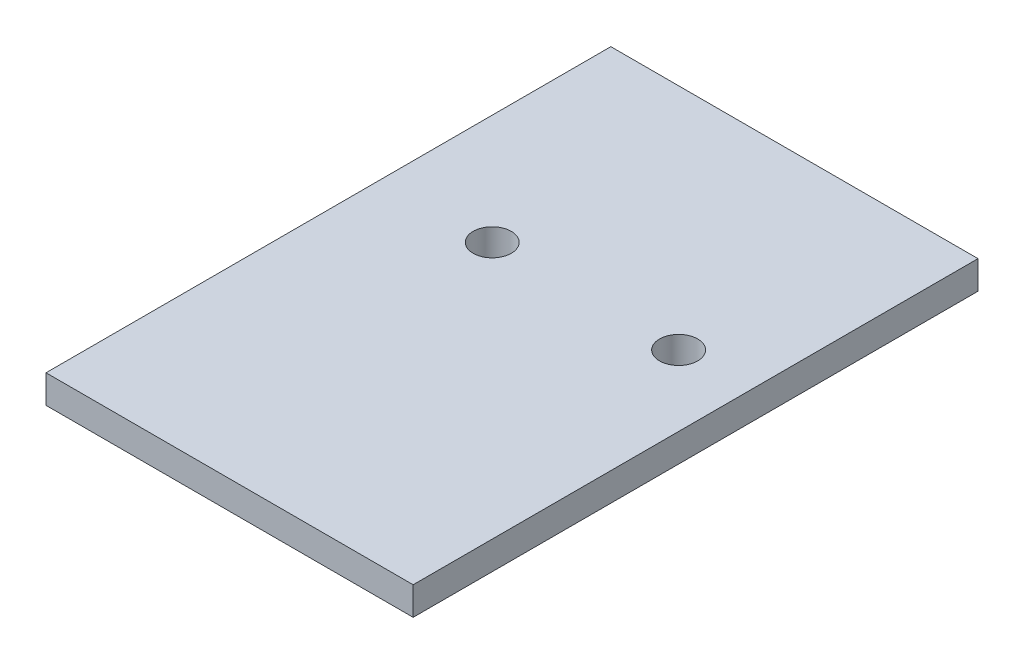
ISO-10303-21;
HEADER;
FILE_DESCRIPTION(('STEP AP214'),'2;1');
FILE_NAME('part.step','',(''),(''),'','','');
FILE_SCHEMA(('AUTOMOTIVE_DESIGN { 1 0 10303 214 1 1 1 1 }'));
ENDSEC;
DATA;
#1=APPLICATION_CONTEXT('core data for automotive mechanical design processes');
#2=APPLICATION_PROTOCOL_DEFINITION('international standard','automotive_design',2000,#1);
#3=PRODUCT_CONTEXT('',#1,'mechanical');
#4=PRODUCT('Part','Part','',(#3));
#5=PRODUCT_RELATED_PRODUCT_CATEGORY('part','',(#4));
#6=PRODUCT_DEFINITION_FORMATION('','',#4);
#7=PRODUCT_DEFINITION_CONTEXT('part definition',#1,'design');
#8=PRODUCT_DEFINITION('design','',#6,#7);
#9=PRODUCT_DEFINITION_SHAPE('','',#8);
#10=(LENGTH_UNIT() NAMED_UNIT(*) SI_UNIT(.MILLI.,.METRE.));
#11=(NAMED_UNIT(*) PLANE_ANGLE_UNIT() SI_UNIT($,.RADIAN.));
#12=(NAMED_UNIT(*) SI_UNIT($,.STERADIAN.) SOLID_ANGLE_UNIT());
#13=UNCERTAINTY_MEASURE_WITH_UNIT(LENGTH_MEASURE(1.E-05),#10,'distance_accuracy_value','');
#14=(GEOMETRIC_REPRESENTATION_CONTEXT(3) GLOBAL_UNCERTAINTY_ASSIGNED_CONTEXT((#13)) GLOBAL_UNIT_ASSIGNED_CONTEXT((#10,
#11,#12)) REPRESENTATION_CONTEXT('',''));
#15=CARTESIAN_POINT('',(0.,0.,0.));
#16=DIRECTION('',(0.,0.,1.));
#17=DIRECTION('',(1.,0.,0.));
#18=AXIS2_PLACEMENT_3D('',#15,#16,#17);
#19=CARTESIAN_POINT('',(0.,2.54,0.));
#20=DIRECTION('',(0.,-1.,0.));
#21=DIRECTION('',(0.,0.,-1.));
#22=AXIS2_PLACEMENT_3D('',#19,#20,#21);
#23=PLANE('',#22);
#24=DIRECTION('',(0.,0.,1.));
#25=VECTOR('',#24,1.);
#26=CARTESIAN_POINT('',(0.,2.54,0.));
#27=LINE('',#26,#25);
#28=CARTESIAN_POINT('',(0.,2.54,-50.8));
#29=VERTEX_POINT('',#28);
#30=CARTESIAN_POINT('',(0.,2.54,0.));
#31=VERTEX_POINT('',#30);
#32=EDGE_CURVE('E86',#29,#31,#27,.T.);
#33=ORIENTED_EDGE('',*,*,#32,.T.);
#34=DIRECTION('',(1.,0.,0.));
#35=VECTOR('',#34,1.);
#36=CARTESIAN_POINT('',(0.,2.54,0.));
#37=LINE('',#36,#35);
#38=CARTESIAN_POINT('',(33.02,2.54,0.));
#39=VERTEX_POINT('',#38);
#40=EDGE_CURVE('E81',#31,#39,#37,.T.);
#41=ORIENTED_EDGE('',*,*,#40,.T.);
#42=DIRECTION('',(0.,0.,-1.));
#43=VECTOR('',#42,1.);
#44=CARTESIAN_POINT('',(33.02,2.54,0.));
#45=LINE('',#44,#43);
#46=CARTESIAN_POINT('',(33.02,2.54,-50.8));
#47=VERTEX_POINT('',#46);
#48=EDGE_CURVE('E84',#39,#47,#45,.T.);
#49=ORIENTED_EDGE('',*,*,#48,.T.);
#50=DIRECTION('',(-1.,0.,0.));
#51=VECTOR('',#50,1.);
#52=CARTESIAN_POINT('',(0.,2.54,-50.8));
#53=LINE('',#52,#51);
#54=EDGE_CURVE('E51',#47,#29,#53,.T.);
#55=ORIENTED_EDGE('',*,*,#54,.T.);
#56=EDGE_LOOP('',(#33,#41,#49,#55));
#57=FACE_BOUND('',#56,.T.);
#58=CARTESIAN_POINT('',(9.906,2.54,-30.226));
#59=DIRECTION('',(0.,1.,0.));
#60=DIRECTION('',(0.,0.,1.));
#61=AXIS2_PLACEMENT_3D('',#58,#59,#60);
#62=CIRCLE('',#61,1.7145);
#63=CARTESIAN_POINT('',(9.906,2.54,-28.5115));
#64=VERTEX_POINT('',#63);
#65=EDGE_CURVE('E101',#64,#64,#62,.T.);
#66=ORIENTED_EDGE('',*,*,#65,.F.);
#67=EDGE_LOOP('',(#66));
#68=FACE_BOUND('',#67,.T.);
#69=CARTESIAN_POINT('',(26.67,2.54,-30.226));
#70=DIRECTION('',(0.,1.,0.));
#71=DIRECTION('',(0.,0.,1.));
#72=AXIS2_PLACEMENT_3D('',#69,#70,#71);
#73=CIRCLE('',#72,1.7145);
#74=CARTESIAN_POINT('',(26.67,2.54,-28.5115));
#75=VERTEX_POINT('',#74);
#76=EDGE_CURVE('E116',#75,#75,#73,.T.);
#77=ORIENTED_EDGE('',*,*,#76,.F.);
#78=EDGE_LOOP('',(#77));
#79=FACE_BOUND('',#78,.T.);
#80=ADVANCED_FACE('F34',(#57,#68,#79),#23,.F.);
#81=CARTESIAN_POINT('',(0.,0.,0.));
#82=DIRECTION('',(0.,-1.,0.));
#83=DIRECTION('',(0.,0.,-1.));
#84=AXIS2_PLACEMENT_3D('',#81,#82,#83);
#85=PLANE('',#84);
#86=CARTESIAN_POINT('',(9.906,0.,-30.226));
#87=DIRECTION('',(0.,1.,0.));
#88=DIRECTION('',(0.,0.,1.));
#89=AXIS2_PLACEMENT_3D('',#86,#87,#88);
#90=CIRCLE('',#89,1.7145);
#91=CARTESIAN_POINT('',(9.906,0.,-28.5115));
#92=VERTEX_POINT('',#91);
#93=EDGE_CURVE('E113',#92,#92,#90,.T.);
#94=ORIENTED_EDGE('',*,*,#93,.T.);
#95=EDGE_LOOP('',(#94));
#96=FACE_BOUND('',#95,.T.);
#97=DIRECTION('',(0.,0.,1.));
#98=VECTOR('',#97,1.);
#99=CARTESIAN_POINT('',(0.,0.,0.));
#100=LINE('',#99,#98);
#101=CARTESIAN_POINT('',(0.,0.,-50.8));
#102=VERTEX_POINT('',#101);
#103=CARTESIAN_POINT('',(0.,0.,0.));
#104=VERTEX_POINT('',#103);
#105=EDGE_CURVE('E98',#102,#104,#100,.T.);
#106=ORIENTED_EDGE('',*,*,#105,.F.);
#107=DIRECTION('',(-1.,0.,0.));
#108=VECTOR('',#107,1.);
#109=CARTESIAN_POINT('',(0.,0.,-50.8));
#110=LINE('',#109,#108);
#111=CARTESIAN_POINT('',(33.02,0.,-50.8));
#112=VERTEX_POINT('',#111);
#113=EDGE_CURVE('E74',#112,#102,#110,.T.);
#114=ORIENTED_EDGE('',*,*,#113,.F.);
#115=DIRECTION('',(0.,0.,-1.));
#116=VECTOR('',#115,1.);
#117=CARTESIAN_POINT('',(33.02,0.,0.));
#118=LINE('',#117,#116);
#119=CARTESIAN_POINT('',(33.02,0.,0.));
#120=VERTEX_POINT('',#119);
#121=EDGE_CURVE('E68',#120,#112,#118,.T.);
#122=ORIENTED_EDGE('',*,*,#121,.F.);
#123=DIRECTION('',(1.,0.,0.));
#124=VECTOR('',#123,1.);
#125=CARTESIAN_POINT('',(0.,0.,0.));
#126=LINE('',#125,#124);
#127=EDGE_CURVE('E90',#104,#120,#126,.T.);
#128=ORIENTED_EDGE('',*,*,#127,.F.);
#129=EDGE_LOOP('',(#106,#114,#122,#128));
#130=FACE_BOUND('',#129,.T.);
#131=CARTESIAN_POINT('',(26.67,0.,-30.226));
#132=DIRECTION('',(0.,1.,0.));
#133=DIRECTION('',(0.,0.,1.));
#134=AXIS2_PLACEMENT_3D('',#131,#132,#133);
#135=CIRCLE('',#134,1.7145);
#136=CARTESIAN_POINT('',(26.67,0.,-28.5115));
#137=VERTEX_POINT('',#136);
#138=EDGE_CURVE('E119',#137,#137,#135,.T.);
#139=ORIENTED_EDGE('',*,*,#138,.T.);
#140=EDGE_LOOP('',(#139));
#141=FACE_BOUND('',#140,.T.);
#142=ADVANCED_FACE('F109',(#96,#130,#141),#85,.T.);
#143=CARTESIAN_POINT('',(0.,2.54,0.));
#144=DIRECTION('',(1.,0.,0.));
#145=DIRECTION('',(0.,0.,-1.));
#146=AXIS2_PLACEMENT_3D('',#143,#144,#145);
#147=PLANE('',#146);
#148=ORIENTED_EDGE('',*,*,#105,.T.);
#149=DIRECTION('',(0.,-1.,0.));
#150=VECTOR('',#149,1.);
#151=CARTESIAN_POINT('',(0.,2.54,0.));
#152=LINE('',#151,#150);
#153=EDGE_CURVE('E11',#31,#104,#152,.T.);
#154=ORIENTED_EDGE('',*,*,#153,.F.);
#155=ORIENTED_EDGE('',*,*,#32,.F.);
#156=DIRECTION('',(0.,-1.,0.));
#157=VECTOR('',#156,1.);
#158=CARTESIAN_POINT('',(0.,2.54,-50.8));
#159=LINE('',#158,#157);
#160=EDGE_CURVE('E94',#29,#102,#159,.T.);
#161=ORIENTED_EDGE('',*,*,#160,.T.);
#162=EDGE_LOOP('',(#148,#154,#155,#161));
#163=FACE_BOUND('',#162,.T.);
#164=ADVANCED_FACE('F36',(#163),#147,.F.);
#165=CARTESIAN_POINT('',(0.,2.54,0.));
#166=DIRECTION('',(0.,0.,-1.));
#167=DIRECTION('',(-1.,0.,0.));
#168=AXIS2_PLACEMENT_3D('',#165,#166,#167);
#169=PLANE('',#168);
#170=ORIENTED_EDGE('',*,*,#127,.T.);
#171=DIRECTION('',(0.,-1.,0.));
#172=VECTOR('',#171,1.);
#173=CARTESIAN_POINT('',(33.02,2.54,0.));
#174=LINE('',#173,#172);
#175=EDGE_CURVE('E43',#39,#120,#174,.T.);
#176=ORIENTED_EDGE('',*,*,#175,.F.);
#177=ORIENTED_EDGE('',*,*,#40,.F.);
#178=ORIENTED_EDGE('',*,*,#153,.T.);
#179=EDGE_LOOP('',(#170,#176,#177,#178));
#180=FACE_BOUND('',#179,.T.);
#181=ADVANCED_FACE('F89',(#180),#169,.F.);
#182=CARTESIAN_POINT('',(33.02,2.54,0.));
#183=DIRECTION('',(-1.,0.,0.));
#184=DIRECTION('',(0.,0.,1.));
#185=AXIS2_PLACEMENT_3D('',#182,#183,#184);
#186=PLANE('',#185);
#187=ORIENTED_EDGE('',*,*,#121,.T.);
#188=DIRECTION('',(0.,-1.,0.));
#189=VECTOR('',#188,1.);
#190=CARTESIAN_POINT('',(33.02,2.54,-50.8));
#191=LINE('',#190,#189);
#192=EDGE_CURVE('E91',#47,#112,#191,.T.);
#193=ORIENTED_EDGE('',*,*,#192,.F.);
#194=ORIENTED_EDGE('',*,*,#48,.F.);
#195=ORIENTED_EDGE('',*,*,#175,.T.);
#196=EDGE_LOOP('',(#187,#193,#194,#195));
#197=FACE_BOUND('',#196,.T.);
#198=ADVANCED_FACE('F92',(#197),#186,.F.);
#199=CARTESIAN_POINT('',(0.,2.54,-50.8));
#200=DIRECTION('',(0.,0.,1.));
#201=DIRECTION('',(1.,0.,0.));
#202=AXIS2_PLACEMENT_3D('',#199,#200,#201);
#203=PLANE('',#202);
#204=ORIENTED_EDGE('',*,*,#113,.T.);
#205=ORIENTED_EDGE('',*,*,#160,.F.);
#206=ORIENTED_EDGE('',*,*,#54,.F.);
#207=ORIENTED_EDGE('',*,*,#192,.T.);
#208=EDGE_LOOP('',(#204,#205,#206,#207));
#209=FACE_BOUND('',#208,.T.);
#210=ADVANCED_FACE('F106',(#209),#203,.F.);
#211=CARTESIAN_POINT('',(9.906,2.54,-30.226));
#212=DIRECTION('',(0.,-1.,0.));
#213=DIRECTION('',(0.,0.,-1.));
#214=AXIS2_PLACEMENT_3D('',#211,#212,#213);
#215=CYLINDRICAL_SURFACE('',#214,1.7145);
#216=ORIENTED_EDGE('',*,*,#65,.T.);
#217=EDGE_LOOP('',(#216));
#218=FACE_BOUND('',#217,.T.);
#219=ORIENTED_EDGE('',*,*,#93,.F.);
#220=EDGE_LOOP('',(#219));
#221=FACE_BOUND('',#220,.T.);
#222=ADVANCED_FACE('F136',(#218,#221),#215,.F.);
#223=CARTESIAN_POINT('',(26.67,2.54,-30.226));
#224=DIRECTION('',(0.,-1.,0.));
#225=DIRECTION('',(0.,0.,-1.));
#226=AXIS2_PLACEMENT_3D('',#223,#224,#225);
#227=CYLINDRICAL_SURFACE('',#226,1.7145);
#228=ORIENTED_EDGE('',*,*,#76,.T.);
#229=EDGE_LOOP('',(#228));
#230=FACE_BOUND('',#229,.T.);
#231=ORIENTED_EDGE('',*,*,#138,.F.);
#232=EDGE_LOOP('',(#231));
#233=FACE_BOUND('',#232,.T.);
#234=ADVANCED_FACE('F125',(#230,#233),#227,.F.);
#235=CLOSED_SHELL('',(#80,#142,#164,#181,#198,#210,#222,#234));
#236=MANIFOLD_SOLID_BREP('B2',#235);
#237=ADVANCED_BREP_SHAPE_REPRESENTATION('',(#18,#236),#14);
#238=SHAPE_DEFINITION_REPRESENTATION(#9,#237);
ENDSEC;
END-ISO-10303-21;
